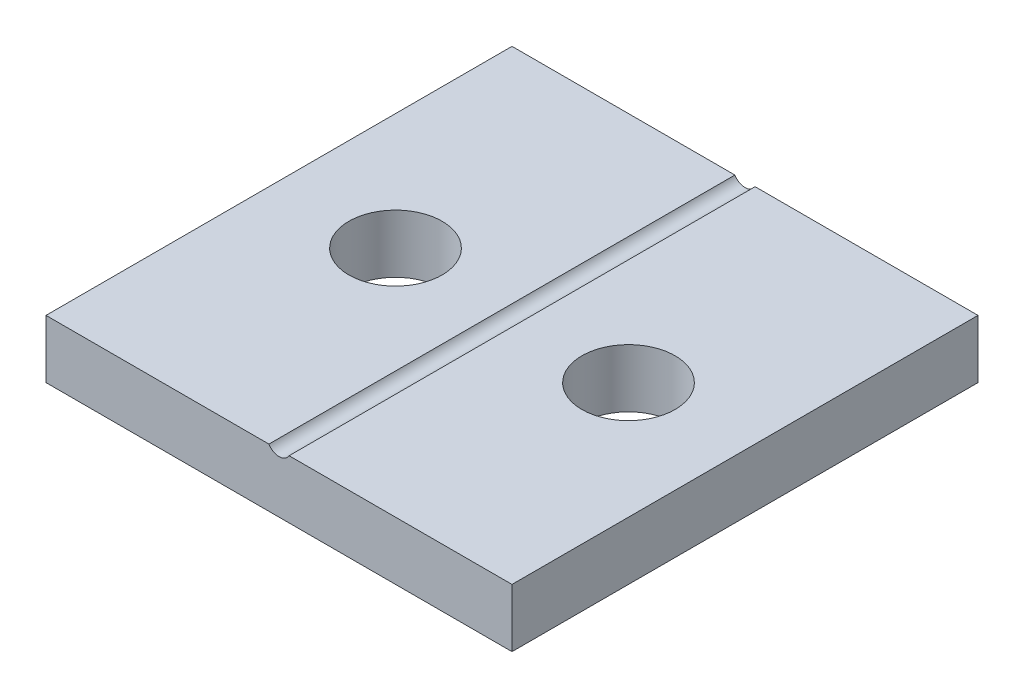
ISO-10303-21;
HEADER;
FILE_DESCRIPTION(('STEP AP214'),'2;1');
FILE_NAME('part.step','',(''),(''),'','','');
FILE_SCHEMA(('AUTOMOTIVE_DESIGN { 1 0 10303 214 1 1 1 1 }'));
ENDSEC;
DATA;
#1=APPLICATION_CONTEXT('core data for automotive mechanical design processes');
#2=APPLICATION_PROTOCOL_DEFINITION('international standard','automotive_design',2000,#1);
#3=PRODUCT_CONTEXT('',#1,'mechanical');
#4=PRODUCT('Part','Part','',(#3));
#5=PRODUCT_RELATED_PRODUCT_CATEGORY('part','',(#4));
#6=PRODUCT_DEFINITION_FORMATION('','',#4);
#7=PRODUCT_DEFINITION_CONTEXT('part definition',#1,'design');
#8=PRODUCT_DEFINITION('design','',#6,#7);
#9=PRODUCT_DEFINITION_SHAPE('','',#8);
#10=(LENGTH_UNIT() NAMED_UNIT(*) SI_UNIT(.MILLI.,.METRE.));
#11=(NAMED_UNIT(*) PLANE_ANGLE_UNIT() SI_UNIT($,.RADIAN.));
#12=(NAMED_UNIT(*) SI_UNIT($,.STERADIAN.) SOLID_ANGLE_UNIT());
#13=UNCERTAINTY_MEASURE_WITH_UNIT(LENGTH_MEASURE(1.E-05),#10,'distance_accuracy_value','');
#14=(GEOMETRIC_REPRESENTATION_CONTEXT(3) GLOBAL_UNCERTAINTY_ASSIGNED_CONTEXT((#13)) GLOBAL_UNIT_ASSIGNED_CONTEXT((#10,
#11,#12)) REPRESENTATION_CONTEXT('',''));
#15=CARTESIAN_POINT('',(0.,0.,0.));
#16=DIRECTION('',(0.,0.,1.));
#17=DIRECTION('',(1.,0.,0.));
#18=AXIS2_PLACEMENT_3D('',#15,#16,#17);
#19=CARTESIAN_POINT('',(0.,2.5,0.));
#20=DIRECTION('',(0.,1.,0.));
#21=DIRECTION('',(0.,0.,1.));
#22=AXIS2_PLACEMENT_3D('',#19,#20,#21);
#23=PLANE('',#22);
#24=CARTESIAN_POINT('',(-55.7547169811321,2.5,-42.0754716981132));
#25=DIRECTION('',(0.,1.,0.));
#26=DIRECTION('',(0.,0.,1.));
#27=AXIS2_PLACEMENT_3D('',#24,#25,#26);
#28=CIRCLE('',#27,2.);
#29=CARTESIAN_POINT('',(-55.7547169811321,2.5,-40.0754716981132));
#30=VERTEX_POINT('',#29);
#31=EDGE_CURVE('E170',#30,#30,#28,.T.);
#32=ORIENTED_EDGE('',*,*,#31,.F.);
#33=EDGE_LOOP('',(#32));
#34=FACE_BOUND('',#33,.T.);
#35=DIRECTION('',(0.,0.,1.));
#36=VECTOR('',#35,1.);
#37=CARTESIAN_POINT('',(-51.1877296830243,2.5,-52.0754716981132));
#38=LINE('',#37,#36);
#39=CARTESIAN_POINT('',(-51.1877296830243,2.5,-52.0754716981132));
#40=VERTEX_POINT('',#39);
#41=CARTESIAN_POINT('',(-51.1877296830243,2.5,-32.0754716981132));
#42=VERTEX_POINT('',#41);
#43=EDGE_CURVE('E11',#40,#42,#38,.T.);
#44=ORIENTED_EDGE('',*,*,#43,.F.);
#45=DIRECTION('',(-1.,0.,0.));
#46=VECTOR('',#45,1.);
#47=CARTESIAN_POINT('',(-60.7547169811321,2.5,-52.0754716981132));
#48=LINE('',#47,#46);
#49=CARTESIAN_POINT('',(-60.7547169811321,2.5,-52.0754716981132));
#50=VERTEX_POINT('',#49);
#51=EDGE_CURVE('E56',#40,#50,#48,.T.);
#52=ORIENTED_EDGE('',*,*,#51,.T.);
#53=DIRECTION('',(0.,0.,1.));
#54=VECTOR('',#53,1.);
#55=CARTESIAN_POINT('',(-60.7547169811321,2.5,-52.0754716981132));
#56=LINE('',#55,#54);
#57=CARTESIAN_POINT('',(-60.7547169811321,2.5,-32.0754716981132));
#58=VERTEX_POINT('',#57);
#59=EDGE_CURVE('E103',#50,#58,#56,.T.);
#60=ORIENTED_EDGE('',*,*,#59,.T.);
#61=DIRECTION('',(1.,0.,0.));
#62=VECTOR('',#61,1.);
#63=CARTESIAN_POINT('',(-60.7547169811321,2.5,-32.0754716981132));
#64=LINE('',#63,#62);
#65=EDGE_CURVE('E85',#58,#42,#64,.T.);
#66=ORIENTED_EDGE('',*,*,#65,.T.);
#67=EDGE_LOOP('',(#44,#52,#60,#66));
#68=FACE_BOUND('',#67,.T.);
#69=ADVANCED_FACE('F33',(#34,#68),#23,.T.);
#70=CARTESIAN_POINT('',(-60.7547169811321,2.5,-52.0754716981132));
#71=DIRECTION('',(1.,0.,0.));
#72=DIRECTION('',(0.,0.,-1.));
#73=AXIS2_PLACEMENT_3D('',#70,#71,#72);
#74=PLANE('',#73);
#75=DIRECTION('',(0.,0.,1.));
#76=VECTOR('',#75,1.);
#77=CARTESIAN_POINT('',(-60.7547169811321,0.,-52.0754716981132));
#78=LINE('',#77,#76);
#79=CARTESIAN_POINT('',(-60.7547169811321,0.,-52.0754716981132));
#80=VERTEX_POINT('',#79);
#81=CARTESIAN_POINT('',(-60.7547169811321,0.,-32.0754716981132));
#82=VERTEX_POINT('',#81);
#83=EDGE_CURVE('E114',#80,#82,#78,.T.);
#84=ORIENTED_EDGE('',*,*,#83,.T.);
#85=DIRECTION('',(0.,-1.,0.));
#86=VECTOR('',#85,1.);
#87=CARTESIAN_POINT('',(-60.7547169811321,2.5,-32.0754716981132));
#88=LINE('',#87,#86);
#89=EDGE_CURVE('E128',#58,#82,#88,.T.);
#90=ORIENTED_EDGE('',*,*,#89,.F.);
#91=ORIENTED_EDGE('',*,*,#59,.F.);
#92=DIRECTION('',(0.,-1.,0.));
#93=VECTOR('',#92,1.);
#94=CARTESIAN_POINT('',(-60.7547169811321,2.5,-52.0754716981132));
#95=LINE('',#94,#93);
#96=EDGE_CURVE('E113',#50,#80,#95,.T.);
#97=ORIENTED_EDGE('',*,*,#96,.T.);
#98=EDGE_LOOP('',(#84,#90,#91,#97));
#99=FACE_BOUND('',#98,.T.);
#100=ADVANCED_FACE('F35',(#99),#74,.F.);
#101=CARTESIAN_POINT('',(-60.7547169811321,2.5,-32.0754716981132));
#102=DIRECTION('',(0.,0.,-1.));
#103=DIRECTION('',(-1.,0.,0.));
#104=AXIS2_PLACEMENT_3D('',#101,#102,#103);
#105=PLANE('',#104);
#106=CARTESIAN_POINT('',(-50.3217042792399,2.5,-32.0754716981132));
#107=VERTEX_POINT('',#106);
#108=CARTESIAN_POINT('',(-40.7547169811321,2.5,-32.0754716981132));
#109=VERTEX_POINT('',#108);
#110=EDGE_CURVE('E99',#107,#109,#64,.T.);
#111=ORIENTED_EDGE('',*,*,#110,.F.);
#112=CARTESIAN_POINT('',(-50.7547169811321,2.75,-32.0754716981132));
#113=DIRECTION('',(0.,0.,1.));
#114=DIRECTION('',(1.,0.,0.));
#115=AXIS2_PLACEMENT_3D('',#112,#113,#114);
#116=CIRCLE('',#115,0.499999999999999);
#117=EDGE_CURVE('E47',#42,#107,#116,.T.);
#118=ORIENTED_EDGE('',*,*,#117,.F.);
#119=ORIENTED_EDGE('',*,*,#65,.F.);
#120=ORIENTED_EDGE('',*,*,#89,.T.);
#121=DIRECTION('',(1.,0.,0.));
#122=VECTOR('',#121,1.);
#123=CARTESIAN_POINT('',(-60.7547169811321,0.,-32.0754716981132));
#124=LINE('',#123,#122);
#125=CARTESIAN_POINT('',(-40.7547169811321,0.,-32.0754716981132));
#126=VERTEX_POINT('',#125);
#127=EDGE_CURVE('E117',#82,#126,#124,.T.);
#128=ORIENTED_EDGE('',*,*,#127,.T.);
#129=DIRECTION('',(0.,-1.,0.));
#130=VECTOR('',#129,1.);
#131=CARTESIAN_POINT('',(-40.7547169811321,2.5,-32.0754716981132));
#132=LINE('',#131,#130);
#133=EDGE_CURVE('E125',#109,#126,#132,.T.);
#134=ORIENTED_EDGE('',*,*,#133,.F.);
#135=EDGE_LOOP('',(#111,#118,#119,#120,#128,#134));
#136=FACE_BOUND('',#135,.T.);
#137=ADVANCED_FACE('F97',(#136),#105,.F.);
#138=CARTESIAN_POINT('',(-40.7547169811321,2.5,-52.0754716981132));
#139=DIRECTION('',(-1.,0.,0.));
#140=DIRECTION('',(0.,0.,1.));
#141=AXIS2_PLACEMENT_3D('',#138,#139,#140);
#142=PLANE('',#141);
#143=DIRECTION('',(0.,0.,-1.));
#144=VECTOR('',#143,1.);
#145=CARTESIAN_POINT('',(-40.7547169811321,0.,-52.0754716981132));
#146=LINE('',#145,#144);
#147=CARTESIAN_POINT('',(-40.7547169811321,0.,-52.0754716981132));
#148=VERTEX_POINT('',#147);
#149=EDGE_CURVE('E119',#126,#148,#146,.T.);
#150=ORIENTED_EDGE('',*,*,#149,.T.);
#151=DIRECTION('',(0.,-1.,0.));
#152=VECTOR('',#151,1.);
#153=CARTESIAN_POINT('',(-40.7547169811321,2.5,-52.0754716981132));
#154=LINE('',#153,#152);
#155=CARTESIAN_POINT('',(-40.7547169811321,2.5,-52.0754716981132));
#156=VERTEX_POINT('',#155);
#157=EDGE_CURVE('E123',#156,#148,#154,.T.);
#158=ORIENTED_EDGE('',*,*,#157,.F.);
#159=DIRECTION('',(0.,0.,-1.));
#160=VECTOR('',#159,1.);
#161=CARTESIAN_POINT('',(-40.7547169811321,2.5,-52.0754716981132));
#162=LINE('',#161,#160);
#163=EDGE_CURVE('E105',#109,#156,#162,.T.);
#164=ORIENTED_EDGE('',*,*,#163,.F.);
#165=ORIENTED_EDGE('',*,*,#133,.T.);
#166=EDGE_LOOP('',(#150,#158,#164,#165));
#167=FACE_BOUND('',#166,.T.);
#168=ADVANCED_FACE('F137',(#167),#142,.F.);
#169=CARTESIAN_POINT('',(-60.7547169811321,2.5,-52.0754716981132));
#170=DIRECTION('',(0.,0.,1.));
#171=DIRECTION('',(1.,0.,0.));
#172=AXIS2_PLACEMENT_3D('',#169,#170,#171);
#173=PLANE('',#172);
#174=ORIENTED_EDGE('',*,*,#51,.F.);
#175=CARTESIAN_POINT('',(-50.7547169811321,2.75,-52.0754716981132));
#176=DIRECTION('',(0.,0.,1.));
#177=DIRECTION('',(1.,0.,0.));
#178=AXIS2_PLACEMENT_3D('',#175,#176,#177);
#179=CIRCLE('',#178,0.499999999999999);
#180=CARTESIAN_POINT('',(-50.3217042792399,2.5,-52.0754716981132));
#181=VERTEX_POINT('',#180);
#182=EDGE_CURVE('E95',#40,#181,#179,.T.);
#183=ORIENTED_EDGE('',*,*,#182,.T.);
#184=EDGE_CURVE('E110',#156,#181,#48,.T.);
#185=ORIENTED_EDGE('',*,*,#184,.F.);
#186=ORIENTED_EDGE('',*,*,#157,.T.);
#187=DIRECTION('',(-1.,0.,0.));
#188=VECTOR('',#187,1.);
#189=CARTESIAN_POINT('',(-60.7547169811321,0.,-52.0754716981132));
#190=LINE('',#189,#188);
#191=EDGE_CURVE('E78',#148,#80,#190,.T.);
#192=ORIENTED_EDGE('',*,*,#191,.T.);
#193=ORIENTED_EDGE('',*,*,#96,.F.);
#194=EDGE_LOOP('',(#174,#183,#185,#186,#192,#193));
#195=FACE_BOUND('',#194,.T.);
#196=ADVANCED_FACE('F131',(#195),#173,.F.);
#197=CARTESIAN_POINT('',(-45.7547169811321,2.5,-42.0754716981132));
#198=DIRECTION('',(0.,1.,0.));
#199=DIRECTION('',(0.,0.,1.));
#200=AXIS2_PLACEMENT_3D('',#197,#198,#199);
#201=CIRCLE('',#200,2.);
#202=CARTESIAN_POINT('',(-45.7547169811321,2.5,-40.0754716981132));
#203=VERTEX_POINT('',#202);
#204=EDGE_CURVE('E165',#203,#203,#201,.T.);
#205=ORIENTED_EDGE('',*,*,#204,.F.);
#206=EDGE_LOOP('',(#205));
#207=FACE_BOUND('',#206,.T.);
#208=DIRECTION('',(0.,0.,1.));
#209=VECTOR('',#208,1.);
#210=CARTESIAN_POINT('',(-50.3217042792399,2.5,-52.0754716981132));
#211=LINE('',#210,#209);
#212=EDGE_CURVE('E41',#107,#181,#211,.F.);
#213=ORIENTED_EDGE('',*,*,#212,.F.);
#214=ORIENTED_EDGE('',*,*,#110,.T.);
#215=ORIENTED_EDGE('',*,*,#163,.T.);
#216=ORIENTED_EDGE('',*,*,#184,.T.);
#217=EDGE_LOOP('',(#213,#214,#215,#216));
#218=FACE_BOUND('',#217,.T.);
#219=ADVANCED_FACE('F133',(#207,#218),#23,.T.);
#220=CARTESIAN_POINT('',(0.,0.,0.));
#221=DIRECTION('',(0.,1.,0.));
#222=DIRECTION('',(0.,0.,1.));
#223=AXIS2_PLACEMENT_3D('',#220,#221,#222);
#224=PLANE('',#223);
#225=CARTESIAN_POINT('',(-45.7547169811321,0.,-42.0754716981132));
#226=DIRECTION('',(0.,1.,0.));
#227=DIRECTION('',(0.,0.,1.));
#228=AXIS2_PLACEMENT_3D('',#225,#226,#227);
#229=CIRCLE('',#228,2.);
#230=CARTESIAN_POINT('',(-45.7547169811321,0.,-40.0754716981132));
#231=VERTEX_POINT('',#230);
#232=EDGE_CURVE('E167',#231,#231,#229,.T.);
#233=ORIENTED_EDGE('',*,*,#232,.T.);
#234=EDGE_LOOP('',(#233));
#235=FACE_BOUND('',#234,.T.);
#236=CARTESIAN_POINT('',(-55.7547169811321,0.,-42.0754716981132));
#237=DIRECTION('',(0.,1.,0.));
#238=DIRECTION('',(0.,0.,1.));
#239=AXIS2_PLACEMENT_3D('',#236,#237,#238);
#240=CIRCLE('',#239,2.);
#241=CARTESIAN_POINT('',(-55.7547169811321,0.,-40.0754716981132));
#242=VERTEX_POINT('',#241);
#243=EDGE_CURVE('E100',#242,#242,#240,.T.);
#244=ORIENTED_EDGE('',*,*,#243,.T.);
#245=EDGE_LOOP('',(#244));
#246=FACE_BOUND('',#245,.T.);
#247=ORIENTED_EDGE('',*,*,#83,.F.);
#248=ORIENTED_EDGE('',*,*,#191,.F.);
#249=ORIENTED_EDGE('',*,*,#149,.F.);
#250=ORIENTED_EDGE('',*,*,#127,.F.);
#251=EDGE_LOOP('',(#247,#248,#249,#250));
#252=FACE_BOUND('',#251,.T.);
#253=ADVANCED_FACE('F141',(#235,#246,#252),#224,.F.);
#254=CARTESIAN_POINT('',(-50.7547169811321,2.75,-52.0754716981132));
#255=DIRECTION('',(0.,0.,1.));
#256=DIRECTION('',(1.,0.,0.));
#257=AXIS2_PLACEMENT_3D('',#254,#255,#256);
#258=CYLINDRICAL_SURFACE('',#257,0.499999999999999);
#259=ORIENTED_EDGE('',*,*,#43,.T.);
#260=ORIENTED_EDGE('',*,*,#117,.T.);
#261=ORIENTED_EDGE('',*,*,#212,.T.);
#262=ORIENTED_EDGE('',*,*,#182,.F.);
#263=EDGE_LOOP('',(#259,#260,#261,#262));
#264=FACE_BOUND('',#263,.T.);
#265=ADVANCED_FACE('F93',(#264),#258,.F.);
#266=CARTESIAN_POINT('',(-55.7547169811321,0.,-42.0754716981132));
#267=DIRECTION('',(0.,1.,0.));
#268=DIRECTION('',(0.,0.,1.));
#269=AXIS2_PLACEMENT_3D('',#266,#267,#268);
#270=CYLINDRICAL_SURFACE('',#269,2.);
#271=ORIENTED_EDGE('',*,*,#243,.F.);
#272=EDGE_LOOP('',(#271));
#273=FACE_BOUND('',#272,.T.);
#274=ORIENTED_EDGE('',*,*,#31,.T.);
#275=EDGE_LOOP('',(#274));
#276=FACE_BOUND('',#275,.T.);
#277=ADVANCED_FACE('F177',(#273,#276),#270,.F.);
#278=CARTESIAN_POINT('',(-45.7547169811321,0.,-42.0754716981132));
#279=DIRECTION('',(0.,1.,0.));
#280=DIRECTION('',(0.,0.,1.));
#281=AXIS2_PLACEMENT_3D('',#278,#279,#280);
#282=CYLINDRICAL_SURFACE('',#281,2.);
#283=ORIENTED_EDGE('',*,*,#232,.F.);
#284=EDGE_LOOP('',(#283));
#285=FACE_BOUND('',#284,.T.);
#286=ORIENTED_EDGE('',*,*,#204,.T.);
#287=EDGE_LOOP('',(#286));
#288=FACE_BOUND('',#287,.T.);
#289=ADVANCED_FACE('F179',(#285,#288),#282,.F.);
#290=CLOSED_SHELL('',(#69,#100,#137,#168,#196,#219,#253,#265,#277,#289));
#291=MANIFOLD_SOLID_BREP('B2',#290);
#292=ADVANCED_BREP_SHAPE_REPRESENTATION('',(#18,#291),#14);
#293=SHAPE_DEFINITION_REPRESENTATION(#9,#292);
ENDSEC;
END-ISO-10303-21;
